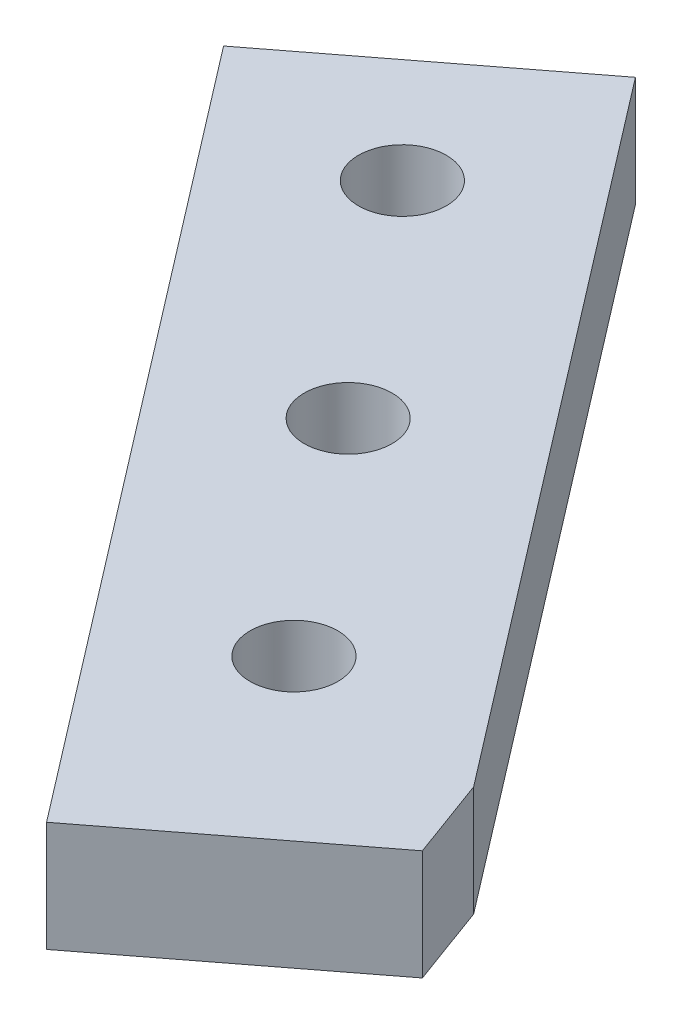
ISO-10303-21;
HEADER;
FILE_DESCRIPTION(('STEP AP214'),'2;1');
FILE_NAME('part.step','',(''),(''),'','','');
FILE_SCHEMA(('AUTOMOTIVE_DESIGN { 1 0 10303 214 1 1 1 1 }'));
ENDSEC;
DATA;
#1=APPLICATION_CONTEXT('core data for automotive mechanical design processes');
#2=APPLICATION_PROTOCOL_DEFINITION('international standard','automotive_design',2000,#1);
#3=PRODUCT_CONTEXT('',#1,'mechanical');
#4=PRODUCT('Part','Part','',(#3));
#5=PRODUCT_RELATED_PRODUCT_CATEGORY('part','',(#4));
#6=PRODUCT_DEFINITION_FORMATION('','',#4);
#7=PRODUCT_DEFINITION_CONTEXT('part definition',#1,'design');
#8=PRODUCT_DEFINITION('design','',#6,#7);
#9=PRODUCT_DEFINITION_SHAPE('','',#8);
#10=(LENGTH_UNIT() NAMED_UNIT(*) SI_UNIT(.MILLI.,.METRE.));
#11=(NAMED_UNIT(*) PLANE_ANGLE_UNIT() SI_UNIT($,.RADIAN.));
#12=(NAMED_UNIT(*) SI_UNIT($,.STERADIAN.) SOLID_ANGLE_UNIT());
#13=UNCERTAINTY_MEASURE_WITH_UNIT(LENGTH_MEASURE(1.E-05),#10,'distance_accuracy_value','');
#14=(GEOMETRIC_REPRESENTATION_CONTEXT(3) GLOBAL_UNCERTAINTY_ASSIGNED_CONTEXT((#13)) GLOBAL_UNIT_ASSIGNED_CONTEXT((#10,
#11,#12)) REPRESENTATION_CONTEXT('',''));
#15=CARTESIAN_POINT('',(0.,0.,0.));
#16=DIRECTION('',(0.,0.,1.));
#17=DIRECTION('',(1.,0.,0.));
#18=AXIS2_PLACEMENT_3D('',#15,#16,#17);
#19=CARTESIAN_POINT('',(-21.6827445640027,4.76249999999999,-28.2575028686426));
#20=DIRECTION('',(0.,1.,0.));
#21=DIRECTION('',(-0.79335334029123,0.,0.608761429008728));
#22=AXIS2_PLACEMENT_3D('',#19,#20,#21);
#23=PLANE('',#22);
#24=CARTESIAN_POINT('',(-114.901008227701,4.76249999999999,58.3763588759356));
#25=DIRECTION('',(0.,1.,0.));
#26=DIRECTION('',(-0.79335334029123,0.,0.608761429008728));
#27=AXIS2_PLACEMENT_3D('',#24,#25,#26);
#28=CIRCLE('',#27,1.89865000000001);
#29=CARTESIAN_POINT('',(-116.407308547245,4.76249999999999,59.532183763123));
#30=VERTEX_POINT('',#29);
#31=EDGE_CURVE('E171',#30,#30,#28,.T.);
#32=ORIENTED_EDGE('',*,*,#31,.F.);
#33=EDGE_LOOP('',(#32));
#34=FACE_BOUND('',#33,.T.);
#35=DIRECTION('',(-0.608761429008728,0.,-0.79335334029123));
#36=VECTOR('',#35,1.);
#37=CARTESIAN_POINT('',(-98.390546202665,4.76249999999999,69.4621962429688));
#38=LINE('',#37,#36);
#39=CARTESIAN_POINT('',(-98.390546202665,4.76249999999999,69.4621962429688));
#40=VERTEX_POINT('',#39);
#41=CARTESIAN_POINT('',(-121.460119739468,4.76249999999998,39.3973426691823));
#42=VERTEX_POINT('',#41);
#43=EDGE_CURVE('E121',#40,#42,#38,.T.);
#44=ORIENTED_EDGE('',*,*,#43,.T.);
#45=DIRECTION('',(-0.793353340291229,0.,0.608761429008729));
#46=VECTOR('',#45,1.);
#47=CARTESIAN_POINT('',(-121.460119739468,4.76249999999998,39.3973426691823));
#48=LINE('',#47,#46);
#49=CARTESIAN_POINT('',(-131.535707161166,4.76249999999998,47.1286128175931));
#50=VERTEX_POINT('',#49);
#51=EDGE_CURVE('E88',#42,#50,#48,.T.);
#52=ORIENTED_EDGE('',*,*,#51,.T.);
#53=DIRECTION('',(0.608761429008726,0.,0.793353340291231));
#54=VECTOR('',#53,1.);
#55=CARTESIAN_POINT('',(-131.535707161166,4.76249999999998,47.1286128175931));
#56=LINE('',#55,#54);
#57=CARTESIAN_POINT('',(-106.298290681686,4.7625,80.0186543186124));
#58=VERTEX_POINT('',#57);
#59=EDGE_CURVE('E92',#50,#58,#56,.T.);
#60=ORIENTED_EDGE('',*,*,#59,.T.);
#61=DIRECTION('',(0.79335334029123,0.,-0.608761429008728));
#62=VECTOR('',#61,1.);
#63=CARTESIAN_POINT('',(-97.1044444212074,4.76249999999998,72.963967959618));
#64=LINE('',#63,#62);
#65=CARTESIAN_POINT('',(-97.1044444212074,4.76249999999998,72.963967959618));
#66=VERTEX_POINT('',#65);
#67=EDGE_CURVE('E96',#58,#66,#64,.T.);
#68=ORIENTED_EDGE('',*,*,#67,.T.);
#69=DIRECTION('',(-0.344755263938466,0.,-0.938692605695133));
#70=VECTOR('',#69,1.);
#71=CARTESIAN_POINT('',(-97.1044444212074,4.76249999999998,72.963967959618));
#72=LINE('',#71,#70);
#73=EDGE_CURVE('E54',#66,#40,#72,.T.);
#74=ORIENTED_EDGE('',*,*,#73,.T.);
#75=EDGE_LOOP('',(#44,#52,#60,#68,#74));
#76=FACE_BOUND('',#75,.T.);
#77=CARTESIAN_POINT('',(-107.16973807929,4.76249999999999,68.4519462976343));
#78=DIRECTION('',(0.,1.,0.));
#79=DIRECTION('',(-0.79335334029123,0.,0.608761429008728));
#80=AXIS2_PLACEMENT_3D('',#77,#78,#79);
#81=CIRCLE('',#80,1.89865);
#82=CARTESIAN_POINT('',(-108.676038398834,4.76249999999999,69.6077711848217));
#83=VERTEX_POINT('',#82);
#84=EDGE_CURVE('E116',#83,#83,#81,.T.);
#85=ORIENTED_EDGE('',*,*,#84,.F.);
#86=EDGE_LOOP('',(#85));
#87=FACE_BOUND('',#86,.T.);
#88=CARTESIAN_POINT('',(-122.632278376111,4.76249999999998,48.300771454237));
#89=DIRECTION('',(0.,1.,0.));
#90=DIRECTION('',(-0.79335334029123,0.,0.608761429008728));
#91=AXIS2_PLACEMENT_3D('',#88,#89,#90);
#92=CIRCLE('',#91,1.89865);
#93=CARTESIAN_POINT('',(-124.138578695655,4.76249999999998,49.4565963414245));
#94=VERTEX_POINT('',#93);
#95=EDGE_CURVE('E162',#94,#94,#92,.T.);
#96=ORIENTED_EDGE('',*,*,#95,.F.);
#97=EDGE_LOOP('',(#96));
#98=FACE_BOUND('',#97,.T.);
#99=ADVANCED_FACE('F37',(#34,#76,#87,#98),#23,.T.);
#100=CARTESIAN_POINT('',(-21.6827445640028,0.,-28.2575028686426));
#101=DIRECTION('',(0.,1.,0.));
#102=DIRECTION('',(-0.79335334029123,0.,0.608761429008728));
#103=AXIS2_PLACEMENT_3D('',#100,#101,#102);
#104=PLANE('',#103);
#105=DIRECTION('',(-0.608761429008728,0.,-0.79335334029123));
#106=VECTOR('',#105,1.);
#107=CARTESIAN_POINT('',(-98.390546202665,0.,69.4621962429688));
#108=LINE('',#107,#106);
#109=CARTESIAN_POINT('',(-98.390546202665,0.,69.4621962429688));
#110=VERTEX_POINT('',#109);
#111=CARTESIAN_POINT('',(-121.460119739468,0.,39.3973426691823));
#112=VERTEX_POINT('',#111);
#113=EDGE_CURVE('E112',#110,#112,#108,.T.);
#114=ORIENTED_EDGE('',*,*,#113,.F.);
#115=DIRECTION('',(-0.344755263938466,0.,-0.938692605695133));
#116=VECTOR('',#115,1.);
#117=CARTESIAN_POINT('',(-97.1044444212074,0.,72.963967959618));
#118=LINE('',#117,#116);
#119=CARTESIAN_POINT('',(-97.1044444212074,0.,72.963967959618));
#120=VERTEX_POINT('',#119);
#121=EDGE_CURVE('E80',#120,#110,#118,.T.);
#122=ORIENTED_EDGE('',*,*,#121,.F.);
#123=DIRECTION('',(0.79335334029123,0.,-0.608761429008728));
#124=VECTOR('',#123,1.);
#125=CARTESIAN_POINT('',(-97.1044444212074,0.,72.963967959618));
#126=LINE('',#125,#124);
#127=CARTESIAN_POINT('',(-106.298290681686,0.,80.0186543186124));
#128=VERTEX_POINT('',#127);
#129=EDGE_CURVE('E74',#128,#120,#126,.T.);
#130=ORIENTED_EDGE('',*,*,#129,.F.);
#131=DIRECTION('',(0.608761429008726,0.,0.793353340291231));
#132=VECTOR('',#131,1.);
#133=CARTESIAN_POINT('',(-131.535707161166,0.,47.1286128175931));
#134=LINE('',#133,#132);
#135=CARTESIAN_POINT('',(-131.535707161166,0.,47.1286128175931));
#136=VERTEX_POINT('',#135);
#137=EDGE_CURVE('E103',#136,#128,#134,.T.);
#138=ORIENTED_EDGE('',*,*,#137,.F.);
#139=DIRECTION('',(-0.793353340291229,0.,0.608761429008729));
#140=VECTOR('',#139,1.);
#141=CARTESIAN_POINT('',(-121.460119739468,0.,39.3973426691823));
#142=LINE('',#141,#140);
#143=EDGE_CURVE('E115',#112,#136,#142,.T.);
#144=ORIENTED_EDGE('',*,*,#143,.F.);
#145=EDGE_LOOP('',(#114,#122,#130,#138,#144));
#146=FACE_BOUND('',#145,.T.);
#147=CARTESIAN_POINT('',(-107.16973807929,0.,68.4519462976343));
#148=DIRECTION('',(0.,1.,0.));
#149=DIRECTION('',(-0.79335334029123,0.,0.608761429008728));
#150=AXIS2_PLACEMENT_3D('',#147,#148,#149);
#151=CIRCLE('',#150,1.89865);
#152=CARTESIAN_POINT('',(-108.676038398834,0.,69.6077711848217));
#153=VERTEX_POINT('',#152);
#154=EDGE_CURVE('E174',#153,#153,#151,.T.);
#155=ORIENTED_EDGE('',*,*,#154,.T.);
#156=EDGE_LOOP('',(#155));
#157=FACE_BOUND('',#156,.T.);
#158=CARTESIAN_POINT('',(-114.901008227701,0.,58.3763588759356));
#159=DIRECTION('',(0.,1.,0.));
#160=DIRECTION('',(-0.79335334029123,0.,0.608761429008728));
#161=AXIS2_PLACEMENT_3D('',#158,#159,#160);
#162=CIRCLE('',#161,1.89865000000001);
#163=CARTESIAN_POINT('',(-116.407308547245,0.,59.532183763123));
#164=VERTEX_POINT('',#163);
#165=EDGE_CURVE('E168',#164,#164,#162,.T.);
#166=ORIENTED_EDGE('',*,*,#165,.T.);
#167=EDGE_LOOP('',(#166));
#168=FACE_BOUND('',#167,.T.);
#169=CARTESIAN_POINT('',(-122.632278376111,0.,48.3007714542371));
#170=DIRECTION('',(0.,1.,0.));
#171=DIRECTION('',(-0.79335334029123,0.,0.608761429008728));
#172=AXIS2_PLACEMENT_3D('',#169,#170,#171);
#173=CIRCLE('',#172,1.89865);
#174=CARTESIAN_POINT('',(-124.138578695655,0.,49.4565963414245));
#175=VERTEX_POINT('',#174);
#176=EDGE_CURVE('E165',#175,#175,#173,.T.);
#177=ORIENTED_EDGE('',*,*,#176,.T.);
#178=EDGE_LOOP('',(#177));
#179=FACE_BOUND('',#178,.T.);
#180=ADVANCED_FACE('F125',(#146,#157,#168,#179),#104,.F.);
#181=CARTESIAN_POINT('',(-98.390546202665,4.76249999999999,69.4621962429688));
#182=DIRECTION('',(-0.79335334029123,0.,0.608761429008728));
#183=DIRECTION('',(0.247605580069033,-0.913545457642603,0.322685874403024));
#184=AXIS2_PLACEMENT_3D('',#181,#182,#183);
#185=PLANE('',#184);
#186=ORIENTED_EDGE('',*,*,#113,.T.);
#187=DIRECTION('',(0.,-1.,0.));
#188=VECTOR('',#187,1.);
#189=CARTESIAN_POINT('',(-121.460119739468,4.76249999999998,39.3973426691823));
#190=LINE('',#189,#188);
#191=EDGE_CURVE('E11',#42,#112,#190,.T.);
#192=ORIENTED_EDGE('',*,*,#191,.F.);
#193=ORIENTED_EDGE('',*,*,#43,.F.);
#194=DIRECTION('',(0.,-1.,0.));
#195=VECTOR('',#194,1.);
#196=CARTESIAN_POINT('',(-98.390546202665,4.76249999999999,69.4621962429688));
#197=LINE('',#196,#195);
#198=EDGE_CURVE('E108',#40,#110,#197,.T.);
#199=ORIENTED_EDGE('',*,*,#198,.T.);
#200=EDGE_LOOP('',(#186,#192,#193,#199));
#201=FACE_BOUND('',#200,.T.);
#202=ADVANCED_FACE('F39',(#201),#185,.F.);
#203=CARTESIAN_POINT('',(-121.460119739468,4.76249999999998,39.3973426691823));
#204=DIRECTION('',(0.608761429008729,0.,0.793353340291229));
#205=DIRECTION('',(-0.455388970406066,-0.818851629035861,0.349432247020535));
#206=AXIS2_PLACEMENT_3D('',#203,#204,#205);
#207=PLANE('',#206);
#208=ORIENTED_EDGE('',*,*,#143,.T.);
#209=DIRECTION('',(0.,-1.,0.));
#210=VECTOR('',#209,1.);
#211=CARTESIAN_POINT('',(-131.535707161166,4.76249999999998,47.1286128175931));
#212=LINE('',#211,#210);
#213=EDGE_CURVE('E46',#50,#136,#212,.T.);
#214=ORIENTED_EDGE('',*,*,#213,.F.);
#215=ORIENTED_EDGE('',*,*,#51,.F.);
#216=ORIENTED_EDGE('',*,*,#191,.T.);
#217=EDGE_LOOP('',(#208,#214,#215,#216));
#218=FACE_BOUND('',#217,.T.);
#219=ADVANCED_FACE('F215',(#218),#207,.F.);
#220=CARTESIAN_POINT('',(-131.535707161166,4.76249999999998,47.1286128175931));
#221=DIRECTION('',(0.793353340291231,0.,-0.608761429008726));
#222=DIRECTION('',(-0.247605580069032,0.913545457642604,-0.322685874403024));
#223=AXIS2_PLACEMENT_3D('',#220,#221,#222);
#224=PLANE('',#223);
#225=ORIENTED_EDGE('',*,*,#137,.T.);
#226=DIRECTION('',(0.,-1.,0.));
#227=VECTOR('',#226,1.);
#228=CARTESIAN_POINT('',(-106.298290681686,4.7625,80.0186543186124));
#229=LINE('',#228,#227);
#230=EDGE_CURVE('E100',#58,#128,#229,.T.);
#231=ORIENTED_EDGE('',*,*,#230,.F.);
#232=ORIENTED_EDGE('',*,*,#59,.F.);
#233=ORIENTED_EDGE('',*,*,#213,.T.);
#234=EDGE_LOOP('',(#225,#231,#232,#233));
#235=FACE_BOUND('',#234,.T.);
#236=ADVANCED_FACE('F101',(#235),#224,.F.);
#237=CARTESIAN_POINT('',(-97.1044444212074,4.76249999999998,72.963967959618));
#238=DIRECTION('',(-0.608761429008728,0.,-0.79335334029123));
#239=DIRECTION('',(0.455388970406067,0.818851629035861,-0.349432247020534));
#240=AXIS2_PLACEMENT_3D('',#237,#238,#239);
#241=PLANE('',#240);
#242=ORIENTED_EDGE('',*,*,#129,.T.);
#243=DIRECTION('',(0.,-1.,0.));
#244=VECTOR('',#243,1.);
#245=CARTESIAN_POINT('',(-97.1044444212074,4.76249999999998,72.963967959618));
#246=LINE('',#245,#244);
#247=EDGE_CURVE('E104',#66,#120,#246,.T.);
#248=ORIENTED_EDGE('',*,*,#247,.F.);
#249=ORIENTED_EDGE('',*,*,#67,.F.);
#250=ORIENTED_EDGE('',*,*,#230,.T.);
#251=EDGE_LOOP('',(#242,#248,#249,#250));
#252=FACE_BOUND('',#251,.T.);
#253=ADVANCED_FACE('F106',(#252),#241,.F.);
#254=CARTESIAN_POINT('',(-97.1044444212074,4.76249999999998,72.963967959618));
#255=DIRECTION('',(-0.938692605695133,0.,0.344755263938466));
#256=DIRECTION('',(0.1457258675655,-0.906272620039637,0.396779421957307));
#257=AXIS2_PLACEMENT_3D('',#254,#255,#256);
#258=PLANE('',#257);
#259=ORIENTED_EDGE('',*,*,#121,.T.);
#260=ORIENTED_EDGE('',*,*,#198,.F.);
#261=ORIENTED_EDGE('',*,*,#73,.F.);
#262=ORIENTED_EDGE('',*,*,#247,.T.);
#263=EDGE_LOOP('',(#259,#260,#261,#262));
#264=FACE_BOUND('',#263,.T.);
#265=ADVANCED_FACE('F130',(#264),#258,.F.);
#266=CARTESIAN_POINT('',(-107.16973807929,4.76249999999999,68.4519462976343));
#267=DIRECTION('',(0.,-1.,0.));
#268=DIRECTION('',(0.79335334029123,0.,-0.608761429008728));
#269=AXIS2_PLACEMENT_3D('',#266,#267,#268);
#270=CYLINDRICAL_SURFACE('',#269,1.89865);
#271=ORIENTED_EDGE('',*,*,#84,.T.);
#272=EDGE_LOOP('',(#271));
#273=FACE_BOUND('',#272,.T.);
#274=ORIENTED_EDGE('',*,*,#154,.F.);
#275=EDGE_LOOP('',(#274));
#276=FACE_BOUND('',#275,.T.);
#277=ADVANCED_FACE('F132',(#273,#276),#270,.F.);
#278=CARTESIAN_POINT('',(-114.901008227701,4.76249999999999,58.3763588759356));
#279=DIRECTION('',(0.,-1.,0.));
#280=DIRECTION('',(0.79335334029123,0.,-0.608761429008728));
#281=AXIS2_PLACEMENT_3D('',#278,#279,#280);
#282=CYLINDRICAL_SURFACE('',#281,1.89865000000001);
#283=ORIENTED_EDGE('',*,*,#31,.T.);
#284=EDGE_LOOP('',(#283));
#285=FACE_BOUND('',#284,.T.);
#286=ORIENTED_EDGE('',*,*,#165,.F.);
#287=EDGE_LOOP('',(#286));
#288=FACE_BOUND('',#287,.T.);
#289=ADVANCED_FACE('F138',(#285,#288),#282,.F.);
#290=CARTESIAN_POINT('',(-122.632278376111,4.76249999999998,48.300771454237));
#291=DIRECTION('',(0.,-1.,0.));
#292=DIRECTION('',(0.79335334029123,0.,-0.608761429008728));
#293=AXIS2_PLACEMENT_3D('',#290,#291,#292);
#294=CYLINDRICAL_SURFACE('',#293,1.89865);
#295=ORIENTED_EDGE('',*,*,#95,.T.);
#296=EDGE_LOOP('',(#295));
#297=FACE_BOUND('',#296,.T.);
#298=ORIENTED_EDGE('',*,*,#176,.F.);
#299=EDGE_LOOP('',(#298));
#300=FACE_BOUND('',#299,.T.);
#301=ADVANCED_FACE('F153',(#297,#300),#294,.F.);
#302=CLOSED_SHELL('',(#99,#180,#202,#219,#236,#253,#265,#277,#289,#301));
#303=MANIFOLD_SOLID_BREP('B2',#302);
#304=ADVANCED_BREP_SHAPE_REPRESENTATION('',(#18,#303),#14);
#305=SHAPE_DEFINITION_REPRESENTATION(#9,#304);
ENDSEC;
END-ISO-10303-21;
